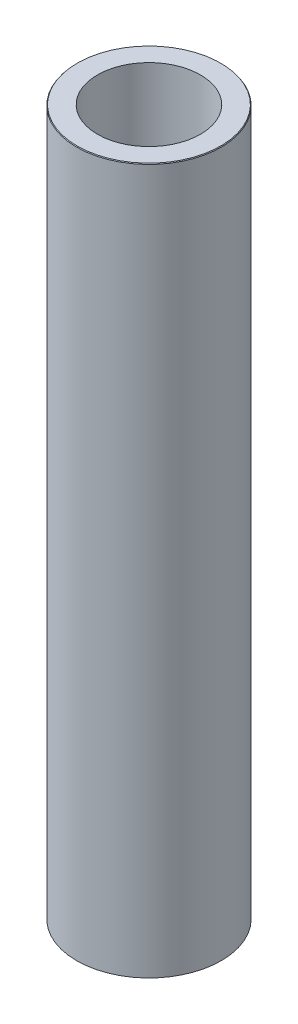
ISO-10303-21;
HEADER;
FILE_DESCRIPTION(('STEP AP214'),'2;1');
FILE_NAME('part.step','',(''),(''),'','','');
FILE_SCHEMA(('AUTOMOTIVE_DESIGN { 1 0 10303 214 1 1 1 1 }'));
ENDSEC;
DATA;
#1=APPLICATION_CONTEXT('core data for automotive mechanical design processes');
#2=APPLICATION_PROTOCOL_DEFINITION('international standard','automotive_design',2000,#1);
#3=PRODUCT_CONTEXT('',#1,'mechanical');
#4=PRODUCT('Part','Part','',(#3));
#5=PRODUCT_RELATED_PRODUCT_CATEGORY('part','',(#4));
#6=PRODUCT_DEFINITION_FORMATION('','',#4);
#7=PRODUCT_DEFINITION_CONTEXT('part definition',#1,'design');
#8=PRODUCT_DEFINITION('design','',#6,#7);
#9=PRODUCT_DEFINITION_SHAPE('','',#8);
#10=(LENGTH_UNIT() NAMED_UNIT(*) SI_UNIT(.MILLI.,.METRE.));
#11=(NAMED_UNIT(*) PLANE_ANGLE_UNIT() SI_UNIT($,.RADIAN.));
#12=(NAMED_UNIT(*) SI_UNIT($,.STERADIAN.) SOLID_ANGLE_UNIT());
#13=UNCERTAINTY_MEASURE_WITH_UNIT(LENGTH_MEASURE(1.E-05),#10,'distance_accuracy_value','');
#14=(GEOMETRIC_REPRESENTATION_CONTEXT(3) GLOBAL_UNCERTAINTY_ASSIGNED_CONTEXT((#13)) GLOBAL_UNIT_ASSIGNED_CONTEXT((#10,
#11,#12)) REPRESENTATION_CONTEXT('',''));
#15=CARTESIAN_POINT('',(0.,0.,0.));
#16=DIRECTION('',(0.,0.,1.));
#17=DIRECTION('',(1.,0.,0.));
#18=AXIS2_PLACEMENT_3D('',#15,#16,#17);
#19=CARTESIAN_POINT('',(0.,390.520734460258,0.));
#20=DIRECTION('',(0.,-1.,0.));
#21=DIRECTION('',(0.,0.,-1.));
#22=AXIS2_PLACEMENT_3D('',#19,#20,#21);
#23=CYLINDRICAL_SURFACE('',#22,40.);
#24=CARTESIAN_POINT('',(0.,390.112862213008,0.));
#25=DIRECTION('',(0.,1.,0.));
#26=DIRECTION('',(0.,0.,1.));
#27=AXIS2_PLACEMENT_3D('',#24,#25,#26);
#28=CIRCLE('',#27,40.);
#29=CARTESIAN_POINT('',(0.,390.112862213008,40.));
#30=VERTEX_POINT('',#29);
#31=EDGE_CURVE('E50',#30,#30,#28,.F.);
#32=ORIENTED_EDGE('',*,*,#31,.T.);
#33=EDGE_LOOP('',(#32));
#34=FACE_BOUND('',#33,.T.);
#35=CARTESIAN_POINT('',(0.,0.297873869905707,0.));
#36=DIRECTION('',(0.,1.,0.));
#37=DIRECTION('',(0.,0.,1.));
#38=AXIS2_PLACEMENT_3D('',#35,#36,#37);
#39=CIRCLE('',#38,40.);
#40=CARTESIAN_POINT('',(0.,0.297873869905707,40.));
#41=VERTEX_POINT('',#40);
#42=EDGE_CURVE('E51',#41,#41,#39,.T.);
#43=ORIENTED_EDGE('',*,*,#42,.T.);
#44=EDGE_LOOP('',(#43));
#45=FACE_BOUND('',#44,.T.);
#46=ADVANCED_FACE('F39',(#34,#45),#23,.T.);
#47=CARTESIAN_POINT('',(0.,390.520734460258,0.));
#48=DIRECTION('',(0.,1.,0.));
#49=DIRECTION('',(0.,0.,1.));
#50=AXIS2_PLACEMENT_3D('',#47,#48,#49);
#51=PLANE('',#50);
#52=CARTESIAN_POINT('',(0.,390.520734460258,0.));
#53=DIRECTION('',(0.,1.,0.));
#54=DIRECTION('',(0.,0.,1.));
#55=AXIS2_PLACEMENT_3D('',#52,#53,#54);
#56=CIRCLE('',#55,39.7021261300943);
#57=CARTESIAN_POINT('',(0.,390.520734460258,39.7021261300943));
#58=VERTEX_POINT('',#57);
#59=EDGE_CURVE('E54',#58,#58,#56,.T.);
#60=ORIENTED_EDGE('',*,*,#59,.T.);
#61=EDGE_LOOP('',(#60));
#62=FACE_BOUND('',#61,.T.);
#63=CARTESIAN_POINT('',(0.,390.520734460258,0.));
#64=DIRECTION('',(0.,1.,0.));
#65=DIRECTION('',(0.,0.,1.));
#66=AXIS2_PLACEMENT_3D('',#63,#64,#65);
#67=CIRCLE('',#66,28.4848336458238);
#68=CARTESIAN_POINT('',(0.,390.520734460258,28.4848336458238));
#69=VERTEX_POINT('',#68);
#70=EDGE_CURVE('E58',#69,#69,#67,.T.);
#71=ORIENTED_EDGE('',*,*,#70,.F.);
#72=EDGE_LOOP('',(#71));
#73=FACE_BOUND('',#72,.T.);
#74=ADVANCED_FACE('F69',(#62,#73),#51,.T.);
#75=CARTESIAN_POINT('',(0.,0.,0.));
#76=DIRECTION('',(0.,1.,0.));
#77=DIRECTION('',(0.,0.,1.));
#78=AXIS2_PLACEMENT_3D('',#75,#76,#77);
#79=PLANE('',#78);
#80=CARTESIAN_POINT('',(0.,0.,0.));
#81=DIRECTION('',(0.,1.,0.));
#82=DIRECTION('',(0.,0.,1.));
#83=AXIS2_PLACEMENT_3D('',#80,#81,#82);
#84=CIRCLE('',#83,39.5921277527502);
#85=CARTESIAN_POINT('',(0.,0.,39.5921277527502));
#86=VERTEX_POINT('',#85);
#87=EDGE_CURVE('E10',#86,#86,#84,.F.);
#88=ORIENTED_EDGE('',*,*,#87,.T.);
#89=EDGE_LOOP('',(#88));
#90=FACE_BOUND('',#89,.T.);
#91=CARTESIAN_POINT('',(0.,0.,0.));
#92=DIRECTION('',(0.,1.,0.));
#93=DIRECTION('',(0.,0.,1.));
#94=AXIS2_PLACEMENT_3D('',#91,#92,#93);
#95=CIRCLE('',#94,28.4848336458238);
#96=CARTESIAN_POINT('',(0.,0.,28.4848336458238));
#97=VERTEX_POINT('',#96);
#98=EDGE_CURVE('E63',#97,#97,#95,.T.);
#99=ORIENTED_EDGE('',*,*,#98,.T.);
#100=EDGE_LOOP('',(#99));
#101=FACE_BOUND('',#100,.T.);
#102=ADVANCED_FACE('F75',(#90,#101),#79,.F.);
#103=CARTESIAN_POINT('',(0.,390.520734460258,0.));
#104=DIRECTION('',(0.,-1.,0.));
#105=DIRECTION('',(0.,0.,-1.));
#106=AXIS2_PLACEMENT_3D('',#103,#104,#105);
#107=CYLINDRICAL_SURFACE('',#106,28.4848336458238);
#108=ORIENTED_EDGE('',*,*,#70,.T.);
#109=EDGE_LOOP('',(#108));
#110=FACE_BOUND('',#109,.T.);
#111=ORIENTED_EDGE('',*,*,#98,.F.);
#112=EDGE_LOOP('',(#111));
#113=FACE_BOUND('',#112,.T.);
#114=ADVANCED_FACE('F70',(#110,#113),#107,.F.);
#115=CARTESIAN_POINT('',(0.,390.520734460258,0.));
#116=DIRECTION('',(0.,-1.,0.));
#117=DIRECTION('',(0.,0.,-1.));
#118=AXIS2_PLACEMENT_3D('',#115,#116,#117);
#119=CONICAL_SURFACE('',#118,39.7021261300943,0.630781060126326);
#120=ORIENTED_EDGE('',*,*,#31,.F.);
#121=EDGE_LOOP('',(#120));
#122=FACE_BOUND('',#121,.T.);
#123=ORIENTED_EDGE('',*,*,#59,.F.);
#124=EDGE_LOOP('',(#123));
#125=FACE_BOUND('',#124,.T.);
#126=ADVANCED_FACE('F81',(#122,#125),#119,.T.);
#127=CARTESIAN_POINT('',(0.,0.297873869905707,0.));
#128=DIRECTION('',(0.,1.,0.));
#129=DIRECTION('',(0.,0.,1.));
#130=AXIS2_PLACEMENT_3D('',#127,#128,#129);
#131=CONICAL_SURFACE('',#130,40.,0.940015266668563);
#132=ORIENTED_EDGE('',*,*,#87,.F.);
#133=EDGE_LOOP('',(#132));
#134=FACE_BOUND('',#133,.T.);
#135=ORIENTED_EDGE('',*,*,#42,.F.);
#136=EDGE_LOOP('',(#135));
#137=FACE_BOUND('',#136,.T.);
#138=ADVANCED_FACE('F45',(#134,#137),#131,.T.);
#139=CLOSED_SHELL('',(#46,#74,#102,#114,#126,#138));
#140=MANIFOLD_SOLID_BREP('B2',#139);
#141=ADVANCED_BREP_SHAPE_REPRESENTATION('',(#18,#140),#14);
#142=SHAPE_DEFINITION_REPRESENTATION(#9,#141);
ENDSEC;
END-ISO-10303-21;
